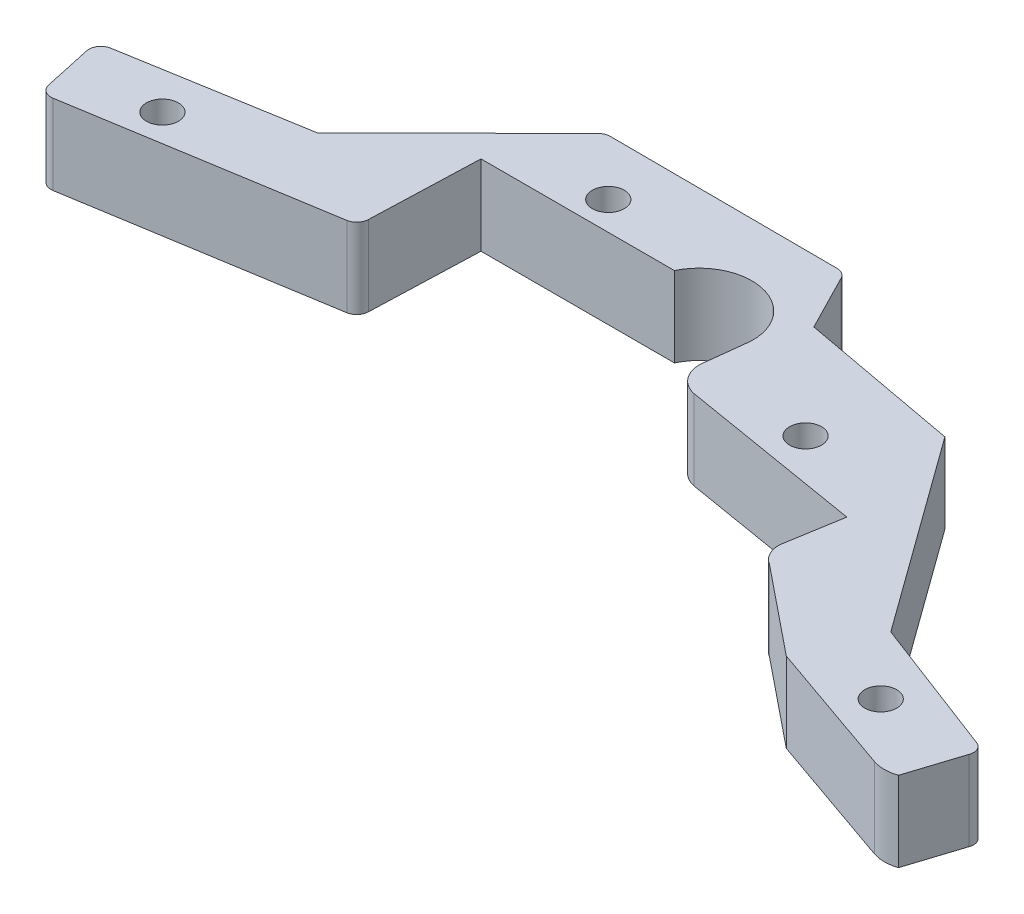
ISO-10303-21;
HEADER;
FILE_DESCRIPTION(('STEP AP214'),'2;1');
FILE_NAME('part.step','',(''),(''),'','','');
FILE_SCHEMA(('AUTOMOTIVE_DESIGN { 1 0 10303 214 1 1 1 1 }'));
ENDSEC;
DATA;
#1=APPLICATION_CONTEXT('core data for automotive mechanical design processes');
#2=APPLICATION_PROTOCOL_DEFINITION('international standard','automotive_design',2000,#1);
#3=PRODUCT_CONTEXT('',#1,'mechanical');
#4=PRODUCT('Part','Part','',(#3));
#5=PRODUCT_RELATED_PRODUCT_CATEGORY('part','',(#4));
#6=PRODUCT_DEFINITION_FORMATION('','',#4);
#7=PRODUCT_DEFINITION_CONTEXT('part definition',#1,'design');
#8=PRODUCT_DEFINITION('design','',#6,#7);
#9=PRODUCT_DEFINITION_SHAPE('','',#8);
#10=(LENGTH_UNIT() NAMED_UNIT(*) SI_UNIT(.MILLI.,.METRE.));
#11=(NAMED_UNIT(*) PLANE_ANGLE_UNIT() SI_UNIT($,.RADIAN.));
#12=(NAMED_UNIT(*) SI_UNIT($,.STERADIAN.) SOLID_ANGLE_UNIT());
#13=UNCERTAINTY_MEASURE_WITH_UNIT(LENGTH_MEASURE(1.E-05),#10,'distance_accuracy_value','');
#14=(GEOMETRIC_REPRESENTATION_CONTEXT(3) GLOBAL_UNCERTAINTY_ASSIGNED_CONTEXT((#13)) GLOBAL_UNIT_ASSIGNED_CONTEXT((#10,
#11,#12)) REPRESENTATION_CONTEXT('',''));
#15=CARTESIAN_POINT('',(0.,0.,0.));
#16=DIRECTION('',(0.,0.,1.));
#17=DIRECTION('',(1.,0.,0.));
#18=AXIS2_PLACEMENT_3D('',#15,#16,#17);
#19=CARTESIAN_POINT('',(0.,5.,-10.2020303320891));
#20=DIRECTION('',(0.,0.,-1.));
#21=DIRECTION('',(-1.,0.,0.));
#22=AXIS2_PLACEMENT_3D('',#19,#20,#21);
#23=PLANE('',#22);
#24=DIRECTION('',(1.,0.,0.));
#25=VECTOR('',#24,1.);
#26=CARTESIAN_POINT('',(0.,0.,-10.2020303320891));
#27=LINE('',#26,#25);
#28=CARTESIAN_POINT('',(17.3596556696452,0.,-10.2020303320891));
#29=VERTEX_POINT('',#28);
#30=CARTESIAN_POINT('',(29.4470757165359,0.,-10.2020303320891));
#31=VERTEX_POINT('',#30);
#32=EDGE_CURVE('E256',#29,#31,#27,.T.);
#33=ORIENTED_EDGE('',*,*,#32,.T.);
#34=DIRECTION('',(0.,-1.,0.));
#35=VECTOR('',#34,1.);
#36=CARTESIAN_POINT('',(29.4470757165359,5.,-10.2020303320891));
#37=LINE('',#36,#35);
#38=CARTESIAN_POINT('',(29.4470757165359,5.,-10.2020303320891));
#39=VERTEX_POINT('',#38);
#40=EDGE_CURVE('E236',#39,#31,#37,.T.);
#41=ORIENTED_EDGE('',*,*,#40,.F.);
#42=DIRECTION('',(1.,0.,0.));
#43=VECTOR('',#42,1.);
#44=CARTESIAN_POINT('',(0.,5.,-10.2020303320891));
#45=LINE('',#44,#43);
#46=CARTESIAN_POINT('',(17.3596556696452,5.,-10.2020303320891));
#47=VERTEX_POINT('',#46);
#48=EDGE_CURVE('E243',#47,#39,#45,.T.);
#49=ORIENTED_EDGE('',*,*,#48,.F.);
#50=DIRECTION('',(0.,-1.,0.));
#51=VECTOR('',#50,1.);
#52=CARTESIAN_POINT('',(17.3596556696452,5.,-10.2020303320891));
#53=LINE('',#52,#51);
#54=EDGE_CURVE('E353',#47,#29,#53,.T.);
#55=ORIENTED_EDGE('',*,*,#54,.T.);
#56=EDGE_LOOP('',(#33,#41,#49,#55));
#57=FACE_BOUND('',#56,.T.);
#58=ADVANCED_FACE('F45',(#57),#23,.F.);
#59=CARTESIAN_POINT('',(32.4210379890428,5.,-8.77204809846736));
#60=DIRECTION('',(0.,-1.,0.));
#61=DIRECTION('',(0.,0.,-1.));
#62=AXIS2_PLACEMENT_3D('',#59,#60,#61);
#63=CYLINDRICAL_SURFACE('',#62,3.29989405690062);
#64=CARTESIAN_POINT('',(32.4210379890428,0.,-8.77204809846736));
#65=DIRECTION('',(0.,1.,0.));
#66=DIRECTION('',(0.,0.,1.));
#67=AXIS2_PLACEMENT_3D('',#64,#65,#66);
#68=CIRCLE('',#67,3.29989405690062);
#69=CARTESIAN_POINT('',(34.4478419373964,0.,-11.3761538070948));
#70=VERTEX_POINT('',#69);
#71=EDGE_CURVE('E428',#31,#70,#68,.F.);
#72=ORIENTED_EDGE('',*,*,#71,.T.);
#73=DIRECTION('',(0.,-1.,0.));
#74=VECTOR('',#73,1.);
#75=CARTESIAN_POINT('',(34.4478419373964,5.,-11.3761538070948));
#76=LINE('',#75,#74);
#77=CARTESIAN_POINT('',(34.4478419373964,5.,-11.3761538070948));
#78=VERTEX_POINT('',#77);
#79=EDGE_CURVE('E239',#78,#70,#76,.T.);
#80=ORIENTED_EDGE('',*,*,#79,.F.);
#81=CARTESIAN_POINT('',(32.4210379890428,5.,-8.77204809846736));
#82=DIRECTION('',(0.,1.,0.));
#83=DIRECTION('',(0.,0.,1.));
#84=AXIS2_PLACEMENT_3D('',#81,#82,#83);
#85=CIRCLE('',#84,3.29989405690062);
#86=EDGE_CURVE('E232',#39,#78,#85,.F.);
#87=ORIENTED_EDGE('',*,*,#86,.F.);
#88=ORIENTED_EDGE('',*,*,#40,.T.);
#89=EDGE_LOOP('',(#72,#80,#87,#88));
#90=FACE_BOUND('',#89,.T.);
#91=ADVANCED_FACE('F234',(#90),#63,.F.);
#92=CARTESIAN_POINT('',(32.5147884750808,5.,-8.89250186809643));
#93=DIRECTION('',(0.,-1.,0.));
#94=DIRECTION('',(0.,0.,-1.));
#95=AXIS2_PLACEMENT_3D('',#92,#93,#94);
#96=CYLINDRICAL_SURFACE('',#95,3.14725636741921);
#97=CARTESIAN_POINT('',(32.5147884750808,0.,-8.89250186809643));
#98=DIRECTION('',(0.,1.,0.));
#99=DIRECTION('',(0.,0.,1.));
#100=AXIS2_PLACEMENT_3D('',#97,#98,#99);
#101=CIRCLE('',#100,3.14725636741921);
#102=CARTESIAN_POINT('',(35.6596253625733,0.,-8.76911794156042));
#103=VERTEX_POINT('',#102);
#104=EDGE_CURVE('E419',#70,#103,#101,.F.);
#105=ORIENTED_EDGE('',*,*,#104,.T.);
#106=DIRECTION('',(0.,-1.,0.));
#107=VECTOR('',#106,1.);
#108=CARTESIAN_POINT('',(35.6596253625733,5.,-8.76911794156042));
#109=LINE('',#108,#107);
#110=CARTESIAN_POINT('',(35.6596253625733,5.,-8.76911794156042));
#111=VERTEX_POINT('',#110);
#112=EDGE_CURVE('E265',#111,#103,#109,.T.);
#113=ORIENTED_EDGE('',*,*,#112,.F.);
#114=CARTESIAN_POINT('',(32.5147884750808,5.,-8.89250186809643));
#115=DIRECTION('',(0.,1.,0.));
#116=DIRECTION('',(0.,0.,1.));
#117=AXIS2_PLACEMENT_3D('',#114,#115,#116);
#118=CIRCLE('',#117,3.14725636741921);
#119=EDGE_CURVE('E242',#78,#111,#118,.F.);
#120=ORIENTED_EDGE('',*,*,#119,.F.);
#121=ORIENTED_EDGE('',*,*,#79,.T.);
#122=EDGE_LOOP('',(#105,#113,#120,#121));
#123=FACE_BOUND('',#122,.T.);
#124=ADVANCED_FACE('F535',(#123),#96,.F.);
#125=CARTESIAN_POINT('',(34.190638006511,5.,3.94910602701749));
#126=DIRECTION('',(0.99339558828256,0.,0.114739727996657));
#127=DIRECTION('',(0.114739727996657,0.,-0.99339558828256));
#128=AXIS2_PLACEMENT_3D('',#125,#126,#127);
#129=PLANE('',#128);
#130=DIRECTION('',(-0.114739727996657,0.,0.99339558828256));
#131=VECTOR('',#130,1.);
#132=CARTESIAN_POINT('',(34.190638006511,0.,3.94910602701749));
#133=LINE('',#132,#131);
#134=CARTESIAN_POINT('',(35.3688034719255,0.,-6.25123518037784));
#135=VERTEX_POINT('',#134);
#136=EDGE_CURVE('E414',#103,#135,#133,.T.);
#137=ORIENTED_EDGE('',*,*,#136,.T.);
#138=DIRECTION('',(0.,-1.,0.));
#139=VECTOR('',#138,1.);
#140=CARTESIAN_POINT('',(35.3688034719255,5.,-6.25123518037784));
#141=LINE('',#140,#139);
#142=CARTESIAN_POINT('',(35.3688034719255,5.,-6.25123518037784));
#143=VERTEX_POINT('',#142);
#144=EDGE_CURVE('E403',#143,#135,#141,.T.);
#145=ORIENTED_EDGE('',*,*,#144,.F.);
#146=DIRECTION('',(-0.114739727996657,0.,0.99339558828256));
#147=VECTOR('',#146,1.);
#148=CARTESIAN_POINT('',(34.190638006511,5.,3.94910602701749));
#149=LINE('',#148,#147);
#150=EDGE_CURVE('E415',#111,#143,#149,.T.);
#151=ORIENTED_EDGE('',*,*,#150,.F.);
#152=ORIENTED_EDGE('',*,*,#112,.T.);
#153=EDGE_LOOP('',(#137,#145,#151,#152));
#154=FACE_BOUND('',#153,.T.);
#155=ADVANCED_FACE('F412',(#154),#129,.F.);
#156=CARTESIAN_POINT('',(37.085025573757,5.,-5.87409912697906));
#157=DIRECTION('',(0.,-1.,0.));
#158=DIRECTION('',(0.,0.,-1.));
#159=AXIS2_PLACEMENT_3D('',#156,#157,#158);
#160=CYLINDRICAL_SURFACE('',#159,1.75717099497687);
#161=CARTESIAN_POINT('',(37.085025573757,0.,-5.87409912697906));
#162=DIRECTION('',(0.,1.,0.));
#163=DIRECTION('',(0.,0.,1.));
#164=AXIS2_PLACEMENT_3D('',#161,#162,#163);
#165=CIRCLE('',#164,1.75717099497687);
#166=CARTESIAN_POINT('',(36.7078895203582,0.,-4.1578770251476));
#167=VERTEX_POINT('',#166);
#168=EDGE_CURVE('E421',#135,#167,#165,.T.);
#169=ORIENTED_EDGE('',*,*,#168,.T.);
#170=DIRECTION('',(0.,-1.,0.));
#171=VECTOR('',#170,1.);
#172=CARTESIAN_POINT('',(36.7078895203582,5.,-4.1578770251476));
#173=LINE('',#172,#171);
#174=CARTESIAN_POINT('',(36.7078895203582,5.,-4.1578770251476));
#175=VERTEX_POINT('',#174);
#176=EDGE_CURVE('E399',#175,#167,#173,.T.);
#177=ORIENTED_EDGE('',*,*,#176,.F.);
#178=CARTESIAN_POINT('',(37.085025573757,5.,-5.87409912697906));
#179=DIRECTION('',(0.,1.,0.));
#180=DIRECTION('',(0.,0.,1.));
#181=AXIS2_PLACEMENT_3D('',#178,#179,#180);
#182=CIRCLE('',#181,1.75717099497687);
#183=EDGE_CURVE('E539',#143,#175,#182,.T.);
#184=ORIENTED_EDGE('',*,*,#183,.F.);
#185=ORIENTED_EDGE('',*,*,#144,.T.);
#186=EDGE_LOOP('',(#169,#177,#184,#185));
#187=FACE_BOUND('',#186,.T.);
#188=ADVANCED_FACE('F702',(#187),#160,.T.);
#189=CARTESIAN_POINT('',(1.66686884046263,5.,-9.99921444516524));
#190=DIRECTION('',(0.164430958280051,0.,-0.986388594803845));
#191=DIRECTION('',(-0.986388594803845,0.,-0.164430958280051));
#192=AXIS2_PLACEMENT_3D('',#189,#190,#191);
#193=PLANE('',#192);
#194=DIRECTION('',(0.986388594803845,0.,0.164430958280051));
#195=VECTOR('',#194,1.);
#196=CARTESIAN_POINT('',(1.66686884046263,0.,-9.99921444516524));
#197=LINE('',#196,#195);
#198=CARTESIAN_POINT('',(48.1787570353814,0.,-2.24568364848568));
#199=VERTEX_POINT('',#198);
#200=EDGE_CURVE('E426',#167,#199,#197,.T.);
#201=ORIENTED_EDGE('',*,*,#200,.T.);
#202=DIRECTION('',(0.,-1.,0.));
#203=VECTOR('',#202,1.);
#204=CARTESIAN_POINT('',(48.1787570353814,5.,-2.24568364848568));
#205=LINE('',#204,#203);
#206=CARTESIAN_POINT('',(48.1787570353814,5.,-2.24568364848568));
#207=VERTEX_POINT('',#206);
#208=EDGE_CURVE('E395',#207,#199,#205,.T.);
#209=ORIENTED_EDGE('',*,*,#208,.F.);
#210=DIRECTION('',(0.986388594803845,0.,0.164430958280051));
#211=VECTOR('',#210,1.);
#212=CARTESIAN_POINT('',(1.66686884046263,5.,-9.99921444516524));
#213=LINE('',#212,#211);
#214=EDGE_CURVE('E544',#175,#207,#213,.T.);
#215=ORIENTED_EDGE('',*,*,#214,.F.);
#216=ORIENTED_EDGE('',*,*,#176,.T.);
#217=EDGE_LOOP('',(#201,#209,#215,#216));
#218=FACE_BOUND('',#217,.T.);
#219=ADVANCED_FACE('F698',(#218),#193,.F.);
#220=CARTESIAN_POINT('',(46.5118881949187,5.,7.75353079667961));
#221=DIRECTION('',(0.986388594803845,0.,0.164430958280052));
#222=DIRECTION('',(0.164430958280052,0.,-0.986388594803845));
#223=AXIS2_PLACEMENT_3D('',#220,#221,#222);
#224=PLANE('',#223);
#225=DIRECTION('',(-0.164430958280052,0.,0.986388594803845));
#226=VECTOR('',#225,1.);
#227=CARTESIAN_POINT('',(46.5118881949187,0.,7.75353079667961));
#228=LINE('',#227,#226);
#229=CARTESIAN_POINT('',(47.5888670401307,0.,1.29294903717399));
#230=VERTEX_POINT('',#229);
#231=EDGE_CURVE('E434',#199,#230,#228,.T.);
#232=ORIENTED_EDGE('',*,*,#231,.T.);
#233=DIRECTION('',(0.,-1.,0.));
#234=VECTOR('',#233,1.);
#235=CARTESIAN_POINT('',(47.5888670401307,5.,1.29294903717399));
#236=LINE('',#235,#234);
#237=CARTESIAN_POINT('',(47.5888670401307,5.,1.29294903717399));
#238=VERTEX_POINT('',#237);
#239=EDGE_CURVE('E391',#238,#230,#236,.T.);
#240=ORIENTED_EDGE('',*,*,#239,.F.);
#241=DIRECTION('',(-0.164430958280052,0.,0.986388594803845));
#242=VECTOR('',#241,1.);
#243=CARTESIAN_POINT('',(46.5118881949187,5.,7.75353079667961));
#244=LINE('',#243,#242);
#245=EDGE_CURVE('E547',#207,#238,#244,.T.);
#246=ORIENTED_EDGE('',*,*,#245,.F.);
#247=ORIENTED_EDGE('',*,*,#208,.T.);
#248=EDGE_LOOP('',(#232,#240,#246,#247));
#249=FACE_BOUND('',#248,.T.);
#250=ADVANCED_FACE('F694',(#249),#224,.F.);
#251=CARTESIAN_POINT('',(49.1113681548911,5.,1.42331019261465));
#252=DIRECTION('',(0.,-1.,0.));
#253=DIRECTION('',(0.,0.,-1.));
#254=AXIS2_PLACEMENT_3D('',#251,#252,#253);
#255=CYLINDRICAL_SURFACE('',#254,1.52807188158619);
#256=CARTESIAN_POINT('',(49.1113681548911,0.,1.42331019261465));
#257=DIRECTION('',(0.,1.,0.));
#258=DIRECTION('',(0.,0.,1.));
#259=AXIS2_PLACEMENT_3D('',#256,#257,#258);
#260=CIRCLE('',#259,1.52807188158619);
#261=CARTESIAN_POINT('',(48.3275970468153,0.,2.7350672301182));
#262=VERTEX_POINT('',#261);
#263=EDGE_CURVE('E437',#230,#262,#260,.T.);
#264=ORIENTED_EDGE('',*,*,#263,.T.);
#265=DIRECTION('',(0.,-1.,0.));
#266=VECTOR('',#265,1.);
#267=CARTESIAN_POINT('',(48.3275970468153,5.,2.7350672301182));
#268=LINE('',#267,#266);
#269=CARTESIAN_POINT('',(48.3275970468153,5.,2.7350672301182));
#270=VERTEX_POINT('',#269);
#271=EDGE_CURVE('E387',#270,#262,#268,.T.);
#272=ORIENTED_EDGE('',*,*,#271,.F.);
#273=CARTESIAN_POINT('',(49.1113681548911,5.,1.42331019261465));
#274=DIRECTION('',(0.,1.,0.));
#275=DIRECTION('',(0.,0.,1.));
#276=AXIS2_PLACEMENT_3D('',#273,#274,#275);
#277=CIRCLE('',#276,1.52807188158619);
#278=EDGE_CURVE('E550',#238,#270,#277,.T.);
#279=ORIENTED_EDGE('',*,*,#278,.F.);
#280=ORIENTED_EDGE('',*,*,#239,.T.);
#281=EDGE_LOOP('',(#264,#272,#279,#280));
#282=FACE_BOUND('',#281,.T.);
#283=ADVANCED_FACE('F690',(#282),#255,.T.);
#284=CARTESIAN_POINT('',(17.7665887768476,5.,-21.9741675810121));
#285=DIRECTION('',(0.628727296441083,0.,-0.777625865509813));
#286=DIRECTION('',(-0.777625865509813,0.,-0.628727296441083));
#287=AXIS2_PLACEMENT_3D('',#284,#285,#286);
#288=PLANE('',#287);
#289=DIRECTION('',(0.777625865509813,0.,0.628727296441083));
#290=VECTOR('',#289,1.);
#291=CARTESIAN_POINT('',(17.7665887768476,0.,-21.9741675810121));
#292=LINE('',#291,#290);
#293=CARTESIAN_POINT('',(53.8072050441704,0.,7.16544856713215));
#294=VERTEX_POINT('',#293);
#295=EDGE_CURVE('E440',#262,#294,#292,.T.);
#296=ORIENTED_EDGE('',*,*,#295,.T.);
#297=DIRECTION('',(0.,-1.,0.));
#298=VECTOR('',#297,1.);
#299=CARTESIAN_POINT('',(53.8072050441704,5.,7.16544856713215));
#300=LINE('',#299,#298);
#301=CARTESIAN_POINT('',(53.8072050441704,5.,7.16544856713215));
#302=VERTEX_POINT('',#301);
#303=EDGE_CURVE('E383',#302,#294,#300,.T.);
#304=ORIENTED_EDGE('',*,*,#303,.F.);
#305=DIRECTION('',(0.777625865509813,0.,0.628727296441083));
#306=VECTOR('',#305,1.);
#307=CARTESIAN_POINT('',(17.7665887768476,5.,-21.9741675810121));
#308=LINE('',#307,#306);
#309=EDGE_CURVE('E553',#270,#302,#308,.T.);
#310=ORIENTED_EDGE('',*,*,#309,.F.);
#311=ORIENTED_EDGE('',*,*,#271,.T.);
#312=EDGE_LOOP('',(#296,#304,#310,#311));
#313=FACE_BOUND('',#312,.T.);
#314=ADVANCED_FACE('F686',(#313),#288,.F.);
#315=CARTESIAN_POINT('',(3.61354884057606,5.,-10.3533132261002));
#316=DIRECTION('',(0.329528892915695,0.,-0.944145491295572));
#317=DIRECTION('',(-0.944145491295572,0.,-0.329528892915695));
#318=AXIS2_PLACEMENT_3D('',#315,#316,#317);
#319=PLANE('',#318);
#320=DIRECTION('',(0.944145491295572,0.,0.329528892915695));
#321=VECTOR('',#320,1.);
#322=CARTESIAN_POINT('',(3.61354884057606,0.,-10.3533132261002));
#323=LINE('',#322,#321);
#324=CARTESIAN_POINT('',(62.2562518540358,0.,10.1143638213133));
#325=VERTEX_POINT('',#324);
#326=EDGE_CURVE('E443',#294,#325,#323,.T.);
#327=ORIENTED_EDGE('',*,*,#326,.T.);
#328=DIRECTION('',(0.,-1.,0.));
#329=VECTOR('',#328,1.);
#330=CARTESIAN_POINT('',(62.2562518540358,5.,10.1143638213133));
#331=LINE('',#330,#329);
#332=CARTESIAN_POINT('',(62.2562518540358,5.,10.1143638213133));
#333=VERTEX_POINT('',#332);
#334=EDGE_CURVE('E379',#333,#325,#331,.T.);
#335=ORIENTED_EDGE('',*,*,#334,.F.);
#336=DIRECTION('',(0.944145491295572,0.,0.329528892915695));
#337=VECTOR('',#336,1.);
#338=CARTESIAN_POINT('',(3.61354884057606,5.,-10.3533132261002));
#339=LINE('',#338,#337);
#340=EDGE_CURVE('E556',#302,#333,#339,.T.);
#341=ORIENTED_EDGE('',*,*,#340,.F.);
#342=ORIENTED_EDGE('',*,*,#303,.T.);
#343=EDGE_LOOP('',(#327,#335,#341,#342));
#344=FACE_BOUND('',#343,.T.);
#345=ADVANCED_FACE('F682',(#344),#319,.F.);
#346=CARTESIAN_POINT('',(63.0113893954729,5.,7.95079115626553));
#347=DIRECTION('',(0.,-1.,0.));
#348=DIRECTION('',(0.,0.,-1.));
#349=AXIS2_PLACEMENT_3D('',#346,#347,#348);
#350=CYLINDRICAL_SURFACE('',#349,2.291567014824);
#351=CARTESIAN_POINT('',(63.0113893954729,0.,7.95079115626553));
#352=DIRECTION('',(0.,1.,0.));
#353=DIRECTION('',(0.,0.,1.));
#354=AXIS2_PLACEMENT_3D('',#351,#352,#353);
#355=CIRCLE('',#354,2.291567014824);
#356=CARTESIAN_POINT('',(63.7688032530278,0.,10.1135679898323));
#357=VERTEX_POINT('',#356);
#358=EDGE_CURVE('E446',#325,#357,#355,.T.);
#359=ORIENTED_EDGE('',*,*,#358,.T.);
#360=DIRECTION('',(0.,-1.,0.));
#361=VECTOR('',#360,1.);
#362=CARTESIAN_POINT('',(63.7688032530278,5.,10.1135679898323));
#363=LINE('',#362,#361);
#364=CARTESIAN_POINT('',(63.7688032530278,5.,10.1135679898323));
#365=VERTEX_POINT('',#364);
#366=EDGE_CURVE('E376',#365,#357,#363,.T.);
#367=ORIENTED_EDGE('',*,*,#366,.F.);
#368=CARTESIAN_POINT('',(63.0113893954729,5.,7.95079115626553));
#369=DIRECTION('',(0.,1.,0.));
#370=DIRECTION('',(0.,0.,1.));
#371=AXIS2_PLACEMENT_3D('',#368,#369,#370);
#372=CIRCLE('',#371,2.291567014824);
#373=EDGE_CURVE('E559',#333,#365,#372,.T.);
#374=ORIENTED_EDGE('',*,*,#373,.F.);
#375=ORIENTED_EDGE('',*,*,#334,.T.);
#376=EDGE_LOOP('',(#359,#367,#374,#375));
#377=FACE_BOUND('',#376,.T.);
#378=ADVANCED_FACE('F678',(#377),#350,.T.);
#379=CARTESIAN_POINT('',(60.7603790159363,5.,19.4916051319322));
#380=DIRECTION('',(0.952204254379973,0.,0.305462040097749));
#381=DIRECTION('',(0.30546204009775,0.,-0.952204254379973));
#382=AXIS2_PLACEMENT_3D('',#379,#380,#381);
#383=PLANE('',#382);
#384=DIRECTION('',(-0.30546204009775,0.,0.952204254379973));
#385=VECTOR('',#384,1.);
#386=CARTESIAN_POINT('',(60.7603790159363,0.,19.4916051319322));
#387=LINE('',#386,#385);
#388=CARTESIAN_POINT('',(64.8389335531438,0.,6.77769481820906));
#389=VERTEX_POINT('',#388);
#390=EDGE_CURVE('E450',#389,#357,#387,.T.);
#391=ORIENTED_EDGE('',*,*,#390,.F.);
#392=DIRECTION('',(0.,-1.,0.));
#393=VECTOR('',#392,1.);
#394=CARTESIAN_POINT('',(64.8389335531438,5.,6.77769481820906));
#395=LINE('',#394,#393);
#396=CARTESIAN_POINT('',(64.8389335531438,5.,6.77769481820906));
#397=VERTEX_POINT('',#396);
#398=EDGE_CURVE('E373',#397,#389,#395,.T.);
#399=ORIENTED_EDGE('',*,*,#398,.F.);
#400=DIRECTION('',(-0.30546204009775,0.,0.952204254379973));
#401=VECTOR('',#400,1.);
#402=CARTESIAN_POINT('',(60.7603790159363,5.,19.4916051319322));
#403=LINE('',#402,#401);
#404=EDGE_CURVE('E562',#397,#365,#403,.T.);
#405=ORIENTED_EDGE('',*,*,#404,.T.);
#406=ORIENTED_EDGE('',*,*,#366,.T.);
#407=EDGE_LOOP('',(#391,#399,#405,#406));
#408=FACE_BOUND('',#407,.T.);
#409=ADVANCED_FACE('F674',(#408),#383,.T.);
#410=CARTESIAN_POINT('',(64.2092712528934,5.,6.53746013382484));
#411=DIRECTION('',(0.,-1.,0.));
#412=DIRECTION('',(0.,0.,-1.));
#413=AXIS2_PLACEMENT_3D('',#410,#411,#412);
#414=CYLINDRICAL_SURFACE('',#413,0.673934207425197);
#415=CARTESIAN_POINT('',(64.2092712528934,0.,6.53746013382484));
#416=DIRECTION('',(0.,1.,0.));
#417=DIRECTION('',(0.,0.,1.));
#418=AXIS2_PLACEMENT_3D('',#415,#416,#417);
#419=CIRCLE('',#418,0.673934207425197);
#420=CARTESIAN_POINT('',(64.4495059372776,0.,5.90779783357443));
#421=VERTEX_POINT('',#420);
#422=EDGE_CURVE('E454',#421,#389,#419,.F.);
#423=ORIENTED_EDGE('',*,*,#422,.F.);
#424=DIRECTION('',(0.,-1.,0.));
#425=VECTOR('',#424,1.);
#426=CARTESIAN_POINT('',(64.4495059372776,5.,5.90779783357443));
#427=LINE('',#426,#425);
#428=CARTESIAN_POINT('',(64.4495059372776,5.,5.90779783357443));
#429=VERTEX_POINT('',#428);
#430=EDGE_CURVE('E370',#429,#421,#427,.T.);
#431=ORIENTED_EDGE('',*,*,#430,.F.);
#432=CARTESIAN_POINT('',(64.2092712528934,5.,6.53746013382484));
#433=DIRECTION('',(0.,1.,0.));
#434=DIRECTION('',(0.,0.,1.));
#435=AXIS2_PLACEMENT_3D('',#432,#433,#434);
#436=CIRCLE('',#435,0.673934207425197);
#437=EDGE_CURVE('E566',#429,#397,#436,.F.);
#438=ORIENTED_EDGE('',*,*,#437,.T.);
#439=ORIENTED_EDGE('',*,*,#398,.T.);
#440=EDGE_LOOP('',(#423,#431,#438,#439));
#441=FACE_BOUND('',#440,.T.);
#442=ADVANCED_FACE('F670',(#441),#414,.T.);
#443=CARTESIAN_POINT('',(6.22188667272531,5.,-16.3077512486902));
#444=DIRECTION('',(0.356466078939749,0.,-0.934308265277216));
#445=DIRECTION('',(-0.934308265277216,0.,-0.356466078939749));
#446=AXIS2_PLACEMENT_3D('',#443,#444,#445);
#447=PLANE('',#446);
#448=DIRECTION('',(0.934308265277216,0.,0.356466078939749));
#449=VECTOR('',#448,1.);
#450=CARTESIAN_POINT('',(6.22188667272531,0.,-16.3077512486902));
#451=LINE('',#450,#449);
#452=CARTESIAN_POINT('',(55.7697517415486,0.,2.5962163574175));
#453=VERTEX_POINT('',#452);
#454=EDGE_CURVE('E458',#453,#421,#451,.T.);
#455=ORIENTED_EDGE('',*,*,#454,.F.);
#456=DIRECTION('',(0.,-1.,0.));
#457=VECTOR('',#456,1.);
#458=CARTESIAN_POINT('',(55.7697517415486,5.,2.5962163574175));
#459=LINE('',#458,#457);
#460=CARTESIAN_POINT('',(55.7697517415486,5.,2.5962163574175));
#461=VERTEX_POINT('',#460);
#462=EDGE_CURVE('E367',#461,#453,#459,.T.);
#463=ORIENTED_EDGE('',*,*,#462,.F.);
#464=DIRECTION('',(0.934308265277216,0.,0.356466078939749));
#465=VECTOR('',#464,1.);
#466=CARTESIAN_POINT('',(6.22188667272531,5.,-16.3077512486902));
#467=LINE('',#466,#465);
#468=EDGE_CURVE('E570',#461,#429,#467,.T.);
#469=ORIENTED_EDGE('',*,*,#468,.T.);
#470=ORIENTED_EDGE('',*,*,#430,.T.);
#471=EDGE_LOOP('',(#455,#463,#469,#470));
#472=FACE_BOUND('',#471,.T.);
#473=ADVANCED_FACE('F667',(#472),#447,.T.);
#474=CARTESIAN_POINT('',(35.3562252161836,5.,-25.5985519509612));
#475=DIRECTION('',(0.809988173314097,0.,-0.586446211592583));
#476=DIRECTION('',(-0.586446211592583,0.,-0.809988173314097));
#477=AXIS2_PLACEMENT_3D('',#474,#475,#476);
#478=PLANE('',#477);
#479=DIRECTION('',(0.586446211592583,0.,0.809988173314097));
#480=VECTOR('',#479,1.);
#481=CARTESIAN_POINT('',(35.3562252161836,0.,-25.5985519509612));
#482=LINE('',#481,#480);
#483=CARTESIAN_POINT('',(46.8998812403582,0.,-9.65467735247833));
#484=VERTEX_POINT('',#483);
#485=EDGE_CURVE('E462',#484,#453,#482,.T.);
#486=ORIENTED_EDGE('',*,*,#485,.F.);
#487=DIRECTION('',(0.,-1.,0.));
#488=VECTOR('',#487,1.);
#489=CARTESIAN_POINT('',(46.8998812403582,5.,-9.65467735247833));
#490=LINE('',#489,#488);
#491=CARTESIAN_POINT('',(46.8998812403582,5.,-9.65467735247833));
#492=VERTEX_POINT('',#491);
#493=EDGE_CURVE('E364',#492,#484,#490,.T.);
#494=ORIENTED_EDGE('',*,*,#493,.F.);
#495=DIRECTION('',(0.586446211592583,0.,0.809988173314097));
#496=VECTOR('',#495,1.);
#497=CARTESIAN_POINT('',(35.3562252161836,5.,-25.5985519509612));
#498=LINE('',#497,#496);
#499=EDGE_CURVE('E574',#492,#461,#498,.T.);
#500=ORIENTED_EDGE('',*,*,#499,.T.);
#501=ORIENTED_EDGE('',*,*,#462,.T.);
#502=EDGE_LOOP('',(#486,#494,#500,#501));
#503=FACE_BOUND('',#502,.T.);
#504=ADVANCED_FACE('F589',(#503),#478,.T.);
#505=CARTESIAN_POINT('',(3.26258249834434,5.,-17.6987599592923));
#506=DIRECTION('',(0.181285206058637,0.,-0.983430563926238));
#507=DIRECTION('',(-0.983430563926238,0.,-0.181285206058637));
#508=AXIS2_PLACEMENT_3D('',#505,#506,#507);
#509=PLANE('',#508);
#510=DIRECTION('',(0.983430563926238,0.,0.181285206058637));
#511=VECTOR('',#510,1.);
#512=CARTESIAN_POINT('',(3.26258249834434,0.,-17.6987599592923));
#513=LINE('',#512,#511);
#514=CARTESIAN_POINT('',(36.8585771832113,0.,-11.5056874205708));
#515=VERTEX_POINT('',#514);
#516=EDGE_CURVE('E466',#515,#484,#513,.T.);
#517=ORIENTED_EDGE('',*,*,#516,.F.);
#518=DIRECTION('',(0.,-1.,0.));
#519=VECTOR('',#518,1.);
#520=CARTESIAN_POINT('',(36.8585771832113,5.,-11.5056874205708));
#521=LINE('',#520,#519);
#522=CARTESIAN_POINT('',(36.8585771832113,5.,-11.5056874205708));
#523=VERTEX_POINT('',#522);
#524=EDGE_CURVE('E360',#523,#515,#521,.T.);
#525=ORIENTED_EDGE('',*,*,#524,.F.);
#526=DIRECTION('',(0.983430563926238,0.,0.181285206058637));
#527=VECTOR('',#526,1.);
#528=CARTESIAN_POINT('',(3.26258249834434,5.,-17.6987599592923));
#529=LINE('',#528,#527);
#530=EDGE_CURVE('E504',#523,#492,#529,.T.);
#531=ORIENTED_EDGE('',*,*,#530,.T.);
#532=ORIENTED_EDGE('',*,*,#493,.T.);
#533=EDGE_LOOP('',(#517,#525,#531,#532));
#534=FACE_BOUND('',#533,.T.);
#535=ADVANCED_FACE('F583',(#534),#509,.T.);
#536=CARTESIAN_POINT('',(33.8658774165045,5.,-17.3479122395638));
#537=DIRECTION('',(0.890022303383639,0.,-0.455916987487505));
#538=DIRECTION('',(-0.455916987487505,0.,-0.890022303383639));
#539=AXIS2_PLACEMENT_3D('',#536,#537,#538);
#540=PLANE('',#539);
#541=DIRECTION('',(0.455916987487505,0.,0.890022303383639));
#542=VECTOR('',#541,1.);
#543=CARTESIAN_POINT('',(33.8658774165045,0.,-17.3479122395638));
#544=LINE('',#543,#542);
#545=CARTESIAN_POINT('',(35.0711589512832,0.,-14.9950114325086));
#546=VERTEX_POINT('',#545);
#547=EDGE_CURVE('E470',#546,#515,#544,.T.);
#548=ORIENTED_EDGE('',*,*,#547,.F.);
#549=DIRECTION('',(0.,-1.,0.));
#550=VECTOR('',#549,1.);
#551=CARTESIAN_POINT('',(35.0711589512832,5.,-14.9950114325086));
#552=LINE('',#551,#550);
#553=CARTESIAN_POINT('',(35.0711589512832,5.,-14.9950114325086));
#554=VERTEX_POINT('',#553);
#555=EDGE_CURVE('E314',#546,#554,#552,.F.);
#556=ORIENTED_EDGE('',*,*,#555,.T.);
#557=DIRECTION('',(0.455916987487505,0.,0.890022303383639));
#558=VECTOR('',#557,1.);
#559=CARTESIAN_POINT('',(33.8658774165045,5.,-17.3479122395638));
#560=LINE('',#559,#558);
#561=EDGE_CURVE('E498',#554,#523,#560,.T.);
#562=ORIENTED_EDGE('',*,*,#561,.T.);
#563=ORIENTED_EDGE('',*,*,#524,.T.);
#564=EDGE_LOOP('',(#548,#556,#562,#563));
#565=FACE_BOUND('',#564,.T.);
#566=ADVANCED_FACE('F594',(#565),#540,.T.);
#567=CARTESIAN_POINT('',(0.0626675462140055,5.,-15.541551461119));
#568=DIRECTION('',(0.00403222528445018,0.,-0.999991870546584));
#569=DIRECTION('',(-0.999991870546584,0.,-0.00403222528445019));
#570=AXIS2_PLACEMENT_3D('',#567,#568,#569);
#571=PLANE('',#570);
#572=DIRECTION('',(0.999991870546584,0.,0.00403222528445019));
#573=VECTOR('',#572,1.);
#574=CARTESIAN_POINT('',(0.0626675462140055,0.,-15.541551461119));
#575=LINE('',#574,#573);
#576=CARTESIAN_POINT('',(20.1839149118569,0.,-15.460417399161));
#577=VERTEX_POINT('',#576);
#578=CARTESIAN_POINT('',(34.4066663927088,0.,-15.4030675948029));
#579=VERTEX_POINT('',#578);
#580=EDGE_CURVE('E473',#577,#579,#575,.T.);
#581=ORIENTED_EDGE('',*,*,#580,.F.);
#582=DIRECTION('',(0.,-1.,0.));
#583=VECTOR('',#582,1.);
#584=CARTESIAN_POINT('',(20.1839149118568,5.,-15.460417399161));
#585=LINE('',#584,#583);
#586=CARTESIAN_POINT('',(20.1839149118569,5.,-15.460417399161));
#587=VERTEX_POINT('',#586);
#588=EDGE_CURVE('E287',#577,#587,#585,.F.);
#589=ORIENTED_EDGE('',*,*,#588,.T.);
#590=DIRECTION('',(0.999991870546584,0.,0.00403222528445019));
#591=VECTOR('',#590,1.);
#592=CARTESIAN_POINT('',(0.0626675462140055,5.,-15.541551461119));
#593=LINE('',#592,#591);
#594=CARTESIAN_POINT('',(34.4066663927088,5.,-15.4030675948029));
#595=VERTEX_POINT('',#594);
#596=EDGE_CURVE('E493',#587,#595,#593,.T.);
#597=ORIENTED_EDGE('',*,*,#596,.T.);
#598=DIRECTION('',(0.,-1.,0.));
#599=VECTOR('',#598,1.);
#600=CARTESIAN_POINT('',(34.4066663927088,5.,-15.4030675948029));
#601=LINE('',#600,#599);
#602=EDGE_CURVE('E283',#595,#579,#601,.T.);
#603=ORIENTED_EDGE('',*,*,#602,.T.);
#604=EDGE_LOOP('',(#581,#589,#597,#603));
#605=FACE_BOUND('',#604,.T.);
#606=ADVANCED_FACE('F492',(#605),#571,.T.);
#607=CARTESIAN_POINT('',(2.12591219714822,5.,2.14312606109274));
#608=DIRECTION('',(-0.704249818952995,0.,-0.709952246636824));
#609=DIRECTION('',(-0.709952246636824,0.,0.704249818952995));
#610=AXIS2_PLACEMENT_3D('',#607,#608,#609);
#611=PLANE('',#610);
#612=DIRECTION('',(0.709952246636824,0.,-0.704249818952995));
#613=VECTOR('',#612,1.);
#614=CARTESIAN_POINT('',(2.12591219714822,5.,2.14312606109274));
#615=LINE('',#614,#613);
#616=CARTESIAN_POINT('',(10.8361960273446,5.,-6.49719564998557));
#617=VERTEX_POINT('',#616);
#618=CARTESIAN_POINT('',(19.6527033786788,5.,-15.2428876812287));
#619=VERTEX_POINT('',#618);
#620=EDGE_CURVE('E485',#617,#619,#615,.T.);
#621=ORIENTED_EDGE('',*,*,#620,.T.);
#622=DIRECTION('',(0.,-1.,0.));
#623=VECTOR('',#622,1.);
#624=CARTESIAN_POINT('',(19.6527033786788,5.,-15.2428876812287));
#625=LINE('',#624,#623);
#626=CARTESIAN_POINT('',(19.6527033786788,0.,-15.2428876812287));
#627=VERTEX_POINT('',#626);
#628=EDGE_CURVE('E258',#619,#627,#625,.T.);
#629=ORIENTED_EDGE('',*,*,#628,.T.);
#630=DIRECTION('',(0.709952246636824,0.,-0.704249818952995));
#631=VECTOR('',#630,1.);
#632=CARTESIAN_POINT('',(2.12591219714822,0.,2.14312606109274));
#633=LINE('',#632,#631);
#634=CARTESIAN_POINT('',(10.8361960273446,0.,-6.49719564998557));
#635=VERTEX_POINT('',#634);
#636=EDGE_CURVE('E346',#635,#627,#633,.T.);
#637=ORIENTED_EDGE('',*,*,#636,.F.);
#638=DIRECTION('',(0.,-1.,0.));
#639=VECTOR('',#638,1.);
#640=CARTESIAN_POINT('',(10.8361960273446,5.,-6.49719564998557));
#641=LINE('',#640,#639);
#642=EDGE_CURVE('E356',#617,#635,#641,.T.);
#643=ORIENTED_EDGE('',*,*,#642,.F.);
#644=EDGE_LOOP('',(#621,#629,#637,#643));
#645=FACE_BOUND('',#644,.T.);
#646=ADVANCED_FACE('F482',(#645),#611,.T.);
#647=CARTESIAN_POINT('',(-0.768261687085168,5.,-4.52849140148716));
#648=DIRECTION('',(-0.167260767588927,0.,-0.985912691685001));
#649=DIRECTION('',(-0.985912691685001,0.,0.167260767588927));
#650=AXIS2_PLACEMENT_3D('',#647,#648,#649);
#651=PLANE('',#650);
#652=DIRECTION('',(0.985912691685001,0.,-0.167260767588927));
#653=VECTOR('',#652,1.);
#654=CARTESIAN_POINT('',(-0.768261687085168,0.,-4.52849140148716));
#655=LINE('',#654,#653);
#656=CARTESIAN_POINT('',(-0.203260715328455,0.,-4.62434420571773));
#657=VERTEX_POINT('',#656);
#658=EDGE_CURVE('E340',#657,#635,#655,.T.);
#659=ORIENTED_EDGE('',*,*,#658,.F.);
#660=DIRECTION('',(0.,-1.,0.));
#661=VECTOR('',#660,1.);
#662=CARTESIAN_POINT('',(-0.203260715328456,5.,-4.62434420571773));
#663=LINE('',#662,#661);
#664=CARTESIAN_POINT('',(-0.203260715328455,5.,-4.62434420571773));
#665=VERTEX_POINT('',#664);
#666=EDGE_CURVE('E11',#657,#665,#663,.F.);
#667=ORIENTED_EDGE('',*,*,#666,.T.);
#668=DIRECTION('',(0.985912691685001,0.,-0.167260767588927));
#669=VECTOR('',#668,1.);
#670=CARTESIAN_POINT('',(-0.768261687085168,5.,-4.52849140148716));
#671=LINE('',#670,#669);
#672=EDGE_CURVE('E502',#665,#617,#671,.T.);
#673=ORIENTED_EDGE('',*,*,#672,.T.);
#674=ORIENTED_EDGE('',*,*,#642,.T.);
#675=EDGE_LOOP('',(#659,#667,#673,#674));
#676=FACE_BOUND('',#675,.T.);
#677=ADVANCED_FACE('F653',(#676),#651,.T.);
#678=CARTESIAN_POINT('',(0.,5.,0.));
#679=DIRECTION('',(-0.977133490782295,0.,0.212626764993511));
#680=DIRECTION('',(0.212626764993511,0.,0.977133490782295));
#681=AXIS2_PLACEMENT_3D('',#678,#679,#680);
#682=PLANE('',#681);
#683=DIRECTION('',(-0.212626764993511,0.,-0.977133490782295));
#684=VECTOR('',#683,1.);
#685=CARTESIAN_POINT('',(0.,5.,0.));
#686=LINE('',#685,#684);
#687=CARTESIAN_POINT('',(-0.15121583483639,5.,-0.694917483975971));
#688=VERTEX_POINT('',#687);
#689=CARTESIAN_POINT('',(-0.810665257723482,5.,-3.72543961320885));
#690=VERTEX_POINT('',#689);
#691=EDGE_CURVE('E330',#688,#690,#686,.T.);
#692=ORIENTED_EDGE('',*,*,#691,.T.);
#693=DIRECTION('',(0.,-1.,0.));
#694=VECTOR('',#693,1.);
#695=CARTESIAN_POINT('',(-0.810665257723482,5.,-3.72543961320885));
#696=LINE('',#695,#694);
#697=CARTESIAN_POINT('',(-0.810665257723482,0.,-3.72543961320885));
#698=VERTEX_POINT('',#697);
#699=EDGE_CURVE('E54',#690,#698,#696,.T.);
#700=ORIENTED_EDGE('',*,*,#699,.T.);
#701=DIRECTION('',(-0.212626764993511,0.,-0.977133490782295));
#702=VECTOR('',#701,1.);
#703=CARTESIAN_POINT('',(0.,0.,0.));
#704=LINE('',#703,#702);
#705=CARTESIAN_POINT('',(-0.15121583483639,0.,-0.694917483975971));
#706=VERTEX_POINT('',#705);
#707=EDGE_CURVE('E327',#706,#698,#704,.T.);
#708=ORIENTED_EDGE('',*,*,#707,.F.);
#709=DIRECTION('',(0.,-1.,0.));
#710=VECTOR('',#709,1.);
#711=CARTESIAN_POINT('',(-0.15121583483639,5.,-0.694917483975971));
#712=LINE('',#711,#710);
#713=EDGE_CURVE('E317',#706,#688,#712,.F.);
#714=ORIENTED_EDGE('',*,*,#713,.T.);
#715=EDGE_LOOP('',(#692,#700,#708,#714));
#716=FACE_BOUND('',#715,.T.);
#717=ADVANCED_FACE('F326',(#716),#682,.T.);
#718=CARTESIAN_POINT('',(0.,5.,0.));
#719=DIRECTION('',(-0.160442874032206,0.,-0.987045127728356));
#720=DIRECTION('',(-0.987045127728356,0.,0.160442874032206));
#721=AXIS2_PLACEMENT_3D('',#718,#719,#720);
#722=PLANE('',#721);
#723=DIRECTION('',(0.987045127728356,0.,-0.160442874032206));
#724=VECTOR('',#723,1.);
#725=CARTESIAN_POINT('',(0.,0.,0.));
#726=LINE('',#725,#724);
#727=CARTESIAN_POINT('',(0.701966438774486,0.,-0.114103711924838));
#728=VERTEX_POINT('',#727);
#729=CARTESIAN_POINT('',(16.493469491576,0.,-2.68099155109679));
#730=VERTEX_POINT('',#729);
#731=EDGE_CURVE('E339',#728,#730,#726,.T.);
#732=ORIENTED_EDGE('',*,*,#731,.T.);
#733=DIRECTION('',(0.,-1.,0.));
#734=VECTOR('',#733,1.);
#735=CARTESIAN_POINT('',(16.493469491576,5.,-2.68099155109679));
#736=LINE('',#735,#734);
#737=CARTESIAN_POINT('',(16.493469491576,5.,-2.68099155109679));
#738=VERTEX_POINT('',#737);
#739=EDGE_CURVE('E69',#730,#738,#736,.F.);
#740=ORIENTED_EDGE('',*,*,#739,.T.);
#741=DIRECTION('',(0.987045127728356,0.,-0.160442874032206));
#742=VECTOR('',#741,1.);
#743=CARTESIAN_POINT('',(0.,5.,0.));
#744=LINE('',#743,#742);
#745=CARTESIAN_POINT('',(0.701966438774486,5.,-0.114103711924838));
#746=VERTEX_POINT('',#745);
#747=EDGE_CURVE('E512',#746,#738,#744,.T.);
#748=ORIENTED_EDGE('',*,*,#747,.F.);
#749=DIRECTION('',(0.,-1.,0.));
#750=VECTOR('',#749,1.);
#751=CARTESIAN_POINT('',(0.701966438774486,0.,-0.114103711924838));
#752=LINE('',#751,#750);
#753=EDGE_CURVE('E308',#746,#728,#752,.T.);
#754=ORIENTED_EDGE('',*,*,#753,.T.);
#755=EDGE_LOOP('',(#732,#740,#748,#754));
#756=FACE_BOUND('',#755,.T.);
#757=ADVANCED_FACE('F619',(#756),#722,.F.);
#758=CARTESIAN_POINT('',(42.4959192801249,5.,-5.34976856941868));
#759=DIRECTION('',(0.,-1.,0.));
#760=DIRECTION('',(0.,0.,-1.));
#761=AXIS2_PLACEMENT_3D('',#758,#759,#760);
#762=CYLINDRICAL_SURFACE('',#761,0.999999999999998);
#763=CARTESIAN_POINT('',(42.4959192801249,5.,-5.34976856941868));
#764=DIRECTION('',(0.,1.,0.));
#765=DIRECTION('',(0.,0.,1.));
#766=AXIS2_PLACEMENT_3D('',#763,#764,#765);
#767=CIRCLE('',#766,0.999999999999998);
#768=CARTESIAN_POINT('',(42.4959192801249,5.,-4.34976856941868));
#769=VERTEX_POINT('',#768);
#770=EDGE_CURVE('E253',#769,#769,#767,.T.);
#771=ORIENTED_EDGE('',*,*,#770,.T.);
#772=EDGE_LOOP('',(#771));
#773=FACE_BOUND('',#772,.T.);
#774=CARTESIAN_POINT('',(42.4959192801249,0.,-5.34976856941868));
#775=DIRECTION('',(0.,1.,0.));
#776=DIRECTION('',(0.,0.,1.));
#777=AXIS2_PLACEMENT_3D('',#774,#775,#776);
#778=CIRCLE('',#777,0.999999999999998);
#779=CARTESIAN_POINT('',(42.4959192801249,0.,-4.34976856941868));
#780=VERTEX_POINT('',#779);
#781=EDGE_CURVE('E529',#780,#780,#778,.T.);
#782=ORIENTED_EDGE('',*,*,#781,.F.);
#783=EDGE_LOOP('',(#782));
#784=FACE_BOUND('',#783,.T.);
#785=ADVANCED_FACE('F615',(#773,#784),#762,.F.);
#786=CARTESIAN_POINT('',(4.8700817774405,5.,-2.77978693403256));
#787=DIRECTION('',(0.,-1.,0.));
#788=DIRECTION('',(0.,0.,-1.));
#789=AXIS2_PLACEMENT_3D('',#786,#787,#788);
#790=CYLINDRICAL_SURFACE('',#789,1.);
#791=CARTESIAN_POINT('',(4.8700817774405,5.,-2.77978693403256));
#792=DIRECTION('',(0.,1.,0.));
#793=DIRECTION('',(0.,0.,1.));
#794=AXIS2_PLACEMENT_3D('',#791,#792,#793);
#795=CIRCLE('',#794,1.);
#796=CARTESIAN_POINT('',(4.8700817774405,5.,-1.77978693403256));
#797=VERTEX_POINT('',#796);
#798=EDGE_CURVE('E1029',#797,#797,#795,.T.);
#799=ORIENTED_EDGE('',*,*,#798,.T.);
#800=EDGE_LOOP('',(#799));
#801=FACE_BOUND('',#800,.T.);
#802=CARTESIAN_POINT('',(4.8700817774405,0.,-2.77978693403256));
#803=DIRECTION('',(0.,1.,0.));
#804=DIRECTION('',(0.,0.,1.));
#805=AXIS2_PLACEMENT_3D('',#802,#803,#804);
#806=CIRCLE('',#805,1.);
#807=CARTESIAN_POINT('',(4.8700817774405,0.,-1.77978693403256));
#808=VERTEX_POINT('',#807);
#809=EDGE_CURVE('E525',#808,#808,#806,.T.);
#810=ORIENTED_EDGE('',*,*,#809,.F.);
#811=EDGE_LOOP('',(#810));
#812=FACE_BOUND('',#811,.T.);
#813=ADVANCED_FACE('F618',(#801,#812),#790,.F.);
#814=CARTESIAN_POINT('',(23.5344774860089,5.,-11.983797813313));
#815=DIRECTION('',(0.,-1.,0.));
#816=DIRECTION('',(0.,0.,-1.));
#817=AXIS2_PLACEMENT_3D('',#814,#815,#816);
#818=CYLINDRICAL_SURFACE('',#817,1.);
#819=CARTESIAN_POINT('',(23.5344774860089,5.,-11.983797813313));
#820=DIRECTION('',(0.,1.,0.));
#821=DIRECTION('',(0.,0.,1.));
#822=AXIS2_PLACEMENT_3D('',#819,#820,#821);
#823=CIRCLE('',#822,1.);
#824=CARTESIAN_POINT('',(23.5344774860089,5.,-10.983797813313));
#825=VERTEX_POINT('',#824);
#826=EDGE_CURVE('E1025',#825,#825,#823,.T.);
#827=ORIENTED_EDGE('',*,*,#826,.T.);
#828=EDGE_LOOP('',(#827));
#829=FACE_BOUND('',#828,.T.);
#830=CARTESIAN_POINT('',(23.5344774860089,0.,-11.983797813313));
#831=DIRECTION('',(0.,1.,0.));
#832=DIRECTION('',(0.,0.,1.));
#833=AXIS2_PLACEMENT_3D('',#830,#831,#832);
#834=CIRCLE('',#833,1.);
#835=CARTESIAN_POINT('',(23.5344774860089,0.,-10.983797813313));
#836=VERTEX_POINT('',#835);
#837=EDGE_CURVE('E521',#836,#836,#834,.T.);
#838=ORIENTED_EDGE('',*,*,#837,.F.);
#839=EDGE_LOOP('',(#838));
#840=FACE_BOUND('',#839,.T.);
#841=ADVANCED_FACE('F623',(#829,#840),#818,.F.);
#842=CARTESIAN_POINT('',(59.0809923898608,5.,6.53746013382484));
#843=DIRECTION('',(0.,-1.,0.));
#844=DIRECTION('',(0.,0.,-1.));
#845=AXIS2_PLACEMENT_3D('',#842,#843,#844);
#846=CYLINDRICAL_SURFACE('',#845,0.999999999999998);
#847=CARTESIAN_POINT('',(59.0809923898608,5.,6.53746013382484));
#848=DIRECTION('',(0.,1.,0.));
#849=DIRECTION('',(0.,0.,1.));
#850=AXIS2_PLACEMENT_3D('',#847,#848,#849);
#851=CIRCLE('',#850,0.999999999999998);
#852=CARTESIAN_POINT('',(59.0809923898608,5.,7.53746013382484));
#853=VERTEX_POINT('',#852);
#854=EDGE_CURVE('E352',#853,#853,#851,.T.);
#855=ORIENTED_EDGE('',*,*,#854,.T.);
#856=EDGE_LOOP('',(#855));
#857=FACE_BOUND('',#856,.T.);
#858=CARTESIAN_POINT('',(59.0809923898608,0.,6.53746013382484));
#859=DIRECTION('',(0.,1.,0.));
#860=DIRECTION('',(0.,0.,1.));
#861=AXIS2_PLACEMENT_3D('',#858,#859,#860);
#862=CIRCLE('',#861,0.999999999999998);
#863=CARTESIAN_POINT('',(59.0809923898608,0.,7.53746013382484));
#864=VERTEX_POINT('',#863);
#865=EDGE_CURVE('E517',#864,#864,#862,.T.);
#866=ORIENTED_EDGE('',*,*,#865,.F.);
#867=EDGE_LOOP('',(#866));
#868=FACE_BOUND('',#867,.T.);
#869=ADVANCED_FACE('F627',(#857,#868),#846,.F.);
#870=CARTESIAN_POINT('',(16.9838995197196,5.,0.591274392513607));
#871=DIRECTION('',(-0.999394549326434,0.,-0.034792740286075));
#872=DIRECTION('',(-0.034792740286075,0.,0.999394549326434));
#873=AXIS2_PLACEMENT_3D('',#870,#871,#872);
#874=PLANE('',#873);
#875=DIRECTION('',(0.034792740286075,0.,-0.999394549326434));
#876=VECTOR('',#875,1.);
#877=CARTESIAN_POINT('',(16.9838995197196,5.,0.591274392513607));
#878=LINE('',#877,#876);
#879=CARTESIAN_POINT('',(17.1226832480467,5.,-3.3951808416785));
#880=VERTEX_POINT('',#879);
#881=EDGE_CURVE('E248',#880,#47,#878,.T.);
#882=ORIENTED_EDGE('',*,*,#881,.F.);
#883=DIRECTION('',(0.,-1.,0.));
#884=VECTOR('',#883,1.);
#885=CARTESIAN_POINT('',(17.1226832480467,5.,-3.3951808416785));
#886=LINE('',#885,#884);
#887=CARTESIAN_POINT('',(17.1226832480467,0.,-3.3951808416785));
#888=VERTEX_POINT('',#887);
#889=EDGE_CURVE('E304',#880,#888,#886,.T.);
#890=ORIENTED_EDGE('',*,*,#889,.T.);
#891=DIRECTION('',(0.034792740286075,0.,-0.999394549326434));
#892=VECTOR('',#891,1.);
#893=CARTESIAN_POINT('',(16.9838995197196,0.,0.591274392513607));
#894=LINE('',#893,#892);
#895=EDGE_CURVE('E344',#888,#29,#894,.T.);
#896=ORIENTED_EDGE('',*,*,#895,.T.);
#897=ORIENTED_EDGE('',*,*,#54,.F.);
#898=EDGE_LOOP('',(#882,#890,#896,#897));
#899=FACE_BOUND('',#898,.T.);
#900=ADVANCED_FACE('F631',(#899),#874,.F.);
#901=CARTESIAN_POINT('',(0.,5.,0.));
#902=DIRECTION('',(0.,1.,0.));
#903=DIRECTION('',(0.,0.,1.));
#904=AXIS2_PLACEMENT_3D('',#901,#902,#903);
#905=PLANE('',#904);
#906=ORIENTED_EDGE('',*,*,#854,.F.);
#907=EDGE_LOOP('',(#906));
#908=FACE_BOUND('',#907,.T.);
#909=ORIENTED_EDGE('',*,*,#826,.F.);
#910=EDGE_LOOP('',(#909));
#911=FACE_BOUND('',#910,.T.);
#912=ORIENTED_EDGE('',*,*,#798,.F.);
#913=EDGE_LOOP('',(#912));
#914=FACE_BOUND('',#913,.T.);
#915=ORIENTED_EDGE('',*,*,#770,.F.);
#916=EDGE_LOOP('',(#915));
#917=FACE_BOUND('',#916,.T.);
#918=ORIENTED_EDGE('',*,*,#596,.F.);
#919=CARTESIAN_POINT('',(20.1808907428935,5.,-14.7104234962511));
#920=DIRECTION('',(0.,1.,0.));
#921=DIRECTION('',(0.,0.,1.));
#922=AXIS2_PLACEMENT_3D('',#919,#920,#921);
#923=CIRCLE('',#922,0.75);
#924=EDGE_CURVE('E301',#587,#619,#923,.T.);
#925=ORIENTED_EDGE('',*,*,#924,.T.);
#926=ORIENTED_EDGE('',*,*,#620,.F.);
#927=ORIENTED_EDGE('',*,*,#672,.F.);
#928=CARTESIAN_POINT('',(-0.0778151396367606,5.,-3.88490968695398));
#929=DIRECTION('',(0.,1.,0.));
#930=DIRECTION('',(0.,0.,1.));
#931=AXIS2_PLACEMENT_3D('',#928,#929,#930);
#932=CIRCLE('',#931,0.75);
#933=EDGE_CURVE('E293',#665,#690,#932,.T.);
#934=ORIENTED_EDGE('',*,*,#933,.T.);
#935=ORIENTED_EDGE('',*,*,#691,.F.);
#936=CARTESIAN_POINT('',(0.581634283250331,5.,-0.854387557721105));
#937=DIRECTION('',(0.,1.,0.));
#938=DIRECTION('',(0.,0.,1.));
#939=AXIS2_PLACEMENT_3D('',#936,#937,#938);
#940=CIRCLE('',#939,0.75);
#941=EDGE_CURVE('E290',#688,#746,#940,.T.);
#942=ORIENTED_EDGE('',*,*,#941,.T.);
#943=ORIENTED_EDGE('',*,*,#747,.T.);
#944=CARTESIAN_POINT('',(16.3731373360519,5.,-3.42127539689305));
#945=DIRECTION('',(0.,1.,0.));
#946=DIRECTION('',(0.,0.,1.));
#947=AXIS2_PLACEMENT_3D('',#944,#945,#946);
#948=CIRCLE('',#947,0.75);
#949=EDGE_CURVE('E61',#738,#880,#948,.T.);
#950=ORIENTED_EDGE('',*,*,#949,.T.);
#951=ORIENTED_EDGE('',*,*,#881,.T.);
#952=ORIENTED_EDGE('',*,*,#48,.T.);
#953=ORIENTED_EDGE('',*,*,#86,.T.);
#954=ORIENTED_EDGE('',*,*,#119,.T.);
#955=ORIENTED_EDGE('',*,*,#150,.T.);
#956=ORIENTED_EDGE('',*,*,#183,.T.);
#957=ORIENTED_EDGE('',*,*,#214,.T.);
#958=ORIENTED_EDGE('',*,*,#245,.T.);
#959=ORIENTED_EDGE('',*,*,#278,.T.);
#960=ORIENTED_EDGE('',*,*,#309,.T.);
#961=ORIENTED_EDGE('',*,*,#340,.T.);
#962=ORIENTED_EDGE('',*,*,#373,.T.);
#963=ORIENTED_EDGE('',*,*,#404,.F.);
#964=ORIENTED_EDGE('',*,*,#437,.F.);
#965=ORIENTED_EDGE('',*,*,#468,.F.);
#966=ORIENTED_EDGE('',*,*,#499,.F.);
#967=ORIENTED_EDGE('',*,*,#530,.F.);
#968=ORIENTED_EDGE('',*,*,#561,.F.);
#969=CARTESIAN_POINT('',(34.4036422237455,5.,-14.653073691893));
#970=DIRECTION('',(0.,1.,0.));
#971=DIRECTION('',(0.,0.,1.));
#972=AXIS2_PLACEMENT_3D('',#969,#970,#971);
#973=CIRCLE('',#972,0.75);
#974=EDGE_CURVE('E296',#554,#595,#973,.T.);
#975=ORIENTED_EDGE('',*,*,#974,.T.);
#976=EDGE_LOOP('',(#918,#925,#926,#927,#934,#935,#942,#943,#950,#951,#952,#953,#954,#955,#956,
#957,#958,#959,#960,#961,#962,#963,#964,#965,#966,#967,#968,#975));
#977=FACE_BOUND('',#976,.T.);
#978=ADVANCED_FACE('F247',(#908,#911,#914,#917,#977),#905,.T.);
#979=CARTESIAN_POINT('',(0.,0.,0.));
#980=DIRECTION('',(0.,1.,0.));
#981=DIRECTION('',(0.,0.,1.));
#982=AXIS2_PLACEMENT_3D('',#979,#980,#981);
#983=PLANE('',#982);
#984=ORIENTED_EDGE('',*,*,#865,.T.);
#985=EDGE_LOOP('',(#984));
#986=FACE_BOUND('',#985,.T.);
#987=ORIENTED_EDGE('',*,*,#837,.T.);
#988=EDGE_LOOP('',(#987));
#989=FACE_BOUND('',#988,.T.);
#990=ORIENTED_EDGE('',*,*,#809,.T.);
#991=EDGE_LOOP('',(#990));
#992=FACE_BOUND('',#991,.T.);
#993=ORIENTED_EDGE('',*,*,#781,.T.);
#994=EDGE_LOOP('',(#993));
#995=FACE_BOUND('',#994,.T.);
#996=ORIENTED_EDGE('',*,*,#636,.T.);
#997=CARTESIAN_POINT('',(20.1808907428935,0.,-14.7104234962511));
#998=DIRECTION('',(0.,1.,0.));
#999=DIRECTION('',(0.,0.,1.));
#1000=AXIS2_PLACEMENT_3D('',#997,#998,#999);
#1001=CIRCLE('',#1000,0.75);
#1002=EDGE_CURVE('E280',#627,#577,#1001,.F.);
#1003=ORIENTED_EDGE('',*,*,#1002,.T.);
#1004=ORIENTED_EDGE('',*,*,#580,.T.);
#1005=CARTESIAN_POINT('',(34.4036422237455,0.,-14.653073691893));
#1006=DIRECTION('',(0.,1.,0.));
#1007=DIRECTION('',(0.,0.,1.));
#1008=AXIS2_PLACEMENT_3D('',#1005,#1006,#1007);
#1009=CIRCLE('',#1008,0.75);
#1010=EDGE_CURVE('E274',#579,#546,#1009,.F.);
#1011=ORIENTED_EDGE('',*,*,#1010,.T.);
#1012=ORIENTED_EDGE('',*,*,#547,.T.);
#1013=ORIENTED_EDGE('',*,*,#516,.T.);
#1014=ORIENTED_EDGE('',*,*,#485,.T.);
#1015=ORIENTED_EDGE('',*,*,#454,.T.);
#1016=ORIENTED_EDGE('',*,*,#422,.T.);
#1017=ORIENTED_EDGE('',*,*,#390,.T.);
#1018=ORIENTED_EDGE('',*,*,#358,.F.);
#1019=ORIENTED_EDGE('',*,*,#326,.F.);
#1020=ORIENTED_EDGE('',*,*,#295,.F.);
#1021=ORIENTED_EDGE('',*,*,#263,.F.);
#1022=ORIENTED_EDGE('',*,*,#231,.F.);
#1023=ORIENTED_EDGE('',*,*,#200,.F.);
#1024=ORIENTED_EDGE('',*,*,#168,.F.);
#1025=ORIENTED_EDGE('',*,*,#136,.F.);
#1026=ORIENTED_EDGE('',*,*,#104,.F.);
#1027=ORIENTED_EDGE('',*,*,#71,.F.);
#1028=ORIENTED_EDGE('',*,*,#32,.F.);
#1029=ORIENTED_EDGE('',*,*,#895,.F.);
#1030=CARTESIAN_POINT('',(16.3731373360519,0.,-3.42127539689305));
#1031=DIRECTION('',(0.,1.,0.));
#1032=DIRECTION('',(0.,0.,1.));
#1033=AXIS2_PLACEMENT_3D('',#1030,#1031,#1032);
#1034=CIRCLE('',#1033,0.75);
#1035=EDGE_CURVE('E277',#888,#730,#1034,.F.);
#1036=ORIENTED_EDGE('',*,*,#1035,.T.);
#1037=ORIENTED_EDGE('',*,*,#731,.F.);
#1038=CARTESIAN_POINT('',(0.581634283250331,0.,-0.854387557721105));
#1039=DIRECTION('',(0.,1.,0.));
#1040=DIRECTION('',(0.,0.,1.));
#1041=AXIS2_PLACEMENT_3D('',#1038,#1039,#1040);
#1042=CIRCLE('',#1041,0.75);
#1043=EDGE_CURVE('E263',#728,#706,#1042,.F.);
#1044=ORIENTED_EDGE('',*,*,#1043,.T.);
#1045=ORIENTED_EDGE('',*,*,#707,.T.);
#1046=CARTESIAN_POINT('',(-0.0778151396367606,0.,-3.88490968695398));
#1047=DIRECTION('',(0.,1.,0.));
#1048=DIRECTION('',(0.,0.,1.));
#1049=AXIS2_PLACEMENT_3D('',#1046,#1047,#1048);
#1050=CIRCLE('',#1049,0.75);
#1051=EDGE_CURVE('E271',#698,#657,#1050,.F.);
#1052=ORIENTED_EDGE('',*,*,#1051,.T.);
#1053=ORIENTED_EDGE('',*,*,#658,.T.);
#1054=EDGE_LOOP('',(#996,#1003,#1004,#1011,#1012,#1013,#1014,#1015,#1016,#1017,#1018,#1019,
#1020,#1021,#1022,#1023,#1024,#1025,#1026,#1027,#1028,#1029,#1036,#1037,#1044,#1045,#1052,#1053));
#1055=FACE_BOUND('',#1054,.T.);
#1056=ADVANCED_FACE('F335',(#986,#989,#992,#995,#1055),#983,.F.);
#1057=CARTESIAN_POINT('',(20.1808907428935,5.,-14.7104234962511));
#1058=DIRECTION('',(0.,-1.,0.));
#1059=DIRECTION('',(0.,0.,-1.));
#1060=AXIS2_PLACEMENT_3D('',#1057,#1058,#1059);
#1061=CYLINDRICAL_SURFACE('',#1060,0.75);
#1062=ORIENTED_EDGE('',*,*,#924,.F.);
#1063=ORIENTED_EDGE('',*,*,#588,.F.);
#1064=ORIENTED_EDGE('',*,*,#1002,.F.);
#1065=ORIENTED_EDGE('',*,*,#628,.F.);
#1066=EDGE_LOOP('',(#1062,#1063,#1064,#1065));
#1067=FACE_BOUND('',#1066,.T.);
#1068=ADVANCED_FACE('F488',(#1067),#1061,.T.);
#1069=CARTESIAN_POINT('',(16.3731373360519,5.,-3.42127539689305));
#1070=DIRECTION('',(0.,-1.,0.));
#1071=DIRECTION('',(0.,0.,-1.));
#1072=AXIS2_PLACEMENT_3D('',#1069,#1070,#1071);
#1073=CYLINDRICAL_SURFACE('',#1072,0.75);
#1074=ORIENTED_EDGE('',*,*,#949,.F.);
#1075=ORIENTED_EDGE('',*,*,#739,.F.);
#1076=ORIENTED_EDGE('',*,*,#1035,.F.);
#1077=ORIENTED_EDGE('',*,*,#889,.F.);
#1078=EDGE_LOOP('',(#1074,#1075,#1076,#1077));
#1079=FACE_BOUND('',#1078,.T.);
#1080=ADVANCED_FACE('F599',(#1079),#1073,.T.);
#1081=CARTESIAN_POINT('',(34.4036422237455,5.,-14.653073691893));
#1082=DIRECTION('',(0.,-1.,0.));
#1083=DIRECTION('',(0.,0.,-1.));
#1084=AXIS2_PLACEMENT_3D('',#1081,#1082,#1083);
#1085=CYLINDRICAL_SURFACE('',#1084,0.75);
#1086=ORIENTED_EDGE('',*,*,#974,.F.);
#1087=ORIENTED_EDGE('',*,*,#555,.F.);
#1088=ORIENTED_EDGE('',*,*,#1010,.F.);
#1089=ORIENTED_EDGE('',*,*,#602,.F.);
#1090=EDGE_LOOP('',(#1086,#1087,#1088,#1089));
#1091=FACE_BOUND('',#1090,.T.);
#1092=ADVANCED_FACE('F596',(#1091),#1085,.T.);
#1093=CARTESIAN_POINT('',(-0.0778151396367606,5.,-3.88490968695398));
#1094=DIRECTION('',(0.,-1.,0.));
#1095=DIRECTION('',(0.,0.,-1.));
#1096=AXIS2_PLACEMENT_3D('',#1093,#1094,#1095);
#1097=CYLINDRICAL_SURFACE('',#1096,0.75);
#1098=ORIENTED_EDGE('',*,*,#933,.F.);
#1099=ORIENTED_EDGE('',*,*,#666,.F.);
#1100=ORIENTED_EDGE('',*,*,#1051,.F.);
#1101=ORIENTED_EDGE('',*,*,#699,.F.);
#1102=EDGE_LOOP('',(#1098,#1099,#1100,#1101));
#1103=FACE_BOUND('',#1102,.T.);
#1104=ADVANCED_FACE('F598',(#1103),#1097,.T.);
#1105=CARTESIAN_POINT('',(0.581634283250331,5.,-0.854387557721105));
#1106=DIRECTION('',(0.,1.,0.));
#1107=DIRECTION('',(0.,0.,1.));
#1108=AXIS2_PLACEMENT_3D('',#1105,#1106,#1107);
#1109=CYLINDRICAL_SURFACE('',#1108,0.75);
#1110=ORIENTED_EDGE('',*,*,#941,.F.);
#1111=ORIENTED_EDGE('',*,*,#713,.F.);
#1112=ORIENTED_EDGE('',*,*,#1043,.F.);
#1113=ORIENTED_EDGE('',*,*,#753,.F.);
#1114=EDGE_LOOP('',(#1110,#1111,#1112,#1113));
#1115=FACE_BOUND('',#1114,.T.);
#1116=ADVANCED_FACE('F47',(#1115),#1109,.T.);
#1117=CLOSED_SHELL('',(#58,#91,#124,#155,#188,#219,#250,#283,#314,#345,#378,#409,#442,#473,#504,
#535,#566,#606,#646,#677,#717,#757,#785,#813,#841,#869,#900,#978,#1056,#1068,#1080,#1092,#1104,#1116));
#1118=MANIFOLD_SOLID_BREP('B2',#1117);
#1119=ADVANCED_BREP_SHAPE_REPRESENTATION('',(#18,#1118),#14);
#1120=SHAPE_DEFINITION_REPRESENTATION(#9,#1119);
ENDSEC;
END-ISO-10303-21;
